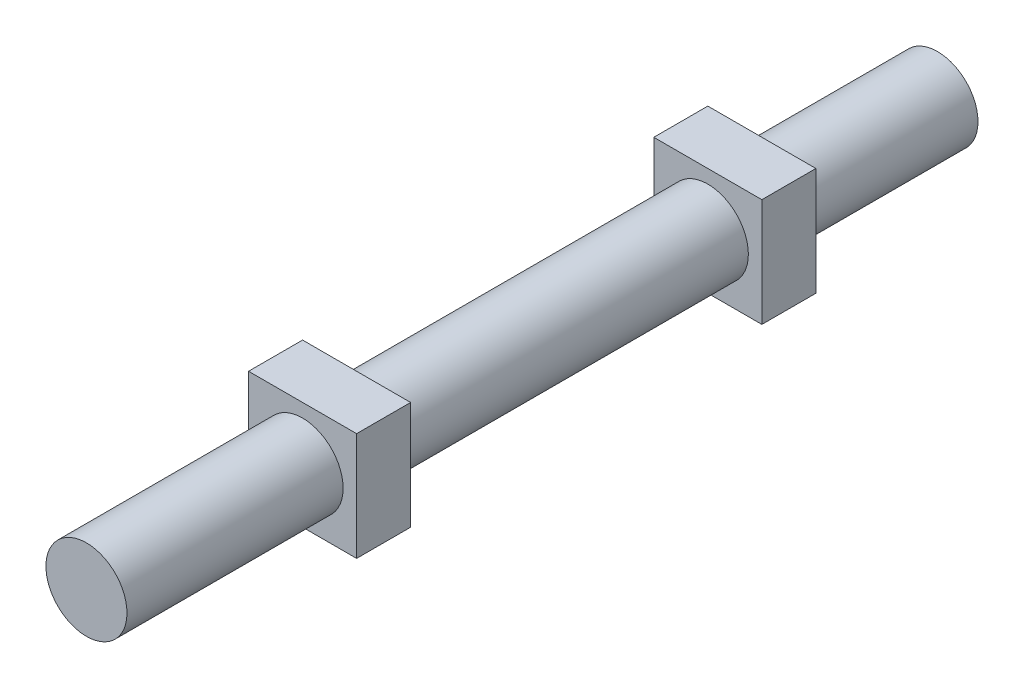
ISO-10303-21;
HEADER;
FILE_DESCRIPTION(('STEP AP214'),'2;1');
FILE_NAME('part.step','',(''),(''),'','','');
FILE_SCHEMA(('AUTOMOTIVE_DESIGN { 1 0 10303 214 1 1 1 1 }'));
ENDSEC;
DATA;
#1=APPLICATION_CONTEXT('core data for automotive mechanical design processes');
#2=APPLICATION_PROTOCOL_DEFINITION('international standard','automotive_design',2000,#1);
#3=PRODUCT_CONTEXT('',#1,'mechanical');
#4=PRODUCT('Part','Part','',(#3));
#5=PRODUCT_RELATED_PRODUCT_CATEGORY('part','',(#4));
#6=PRODUCT_DEFINITION_FORMATION('','',#4);
#7=PRODUCT_DEFINITION_CONTEXT('part definition',#1,'design');
#8=PRODUCT_DEFINITION('design','',#6,#7);
#9=PRODUCT_DEFINITION_SHAPE('','',#8);
#10=(LENGTH_UNIT() NAMED_UNIT(*) SI_UNIT(.MILLI.,.METRE.));
#11=(NAMED_UNIT(*) PLANE_ANGLE_UNIT() SI_UNIT($,.RADIAN.));
#12=(NAMED_UNIT(*) SI_UNIT($,.STERADIAN.) SOLID_ANGLE_UNIT());
#13=UNCERTAINTY_MEASURE_WITH_UNIT(LENGTH_MEASURE(1.E-05),#10,'distance_accuracy_value','');
#14=(GEOMETRIC_REPRESENTATION_CONTEXT(3) GLOBAL_UNCERTAINTY_ASSIGNED_CONTEXT((#13)) GLOBAL_UNIT_ASSIGNED_CONTEXT((#10,
#11,#12)) REPRESENTATION_CONTEXT('',''));
#15=CARTESIAN_POINT('',(0.,0.,0.));
#16=DIRECTION('',(0.,0.,1.));
#17=DIRECTION('',(1.,0.,0.));
#18=AXIS2_PLACEMENT_3D('',#15,#16,#17);
#19=CARTESIAN_POINT('',(0.,0.,157.5));
#20=DIRECTION('',(0.,0.,-1.));
#21=DIRECTION('',(-1.,0.,0.));
#22=AXIS2_PLACEMENT_3D('',#19,#20,#21);
#23=CYLINDRICAL_SURFACE('',#22,7.5);
#24=CARTESIAN_POINT('',(0.,0.,117.5));
#25=DIRECTION('',(0.,0.,1.));
#26=DIRECTION('',(1.,0.,0.));
#27=AXIS2_PLACEMENT_3D('',#24,#25,#26);
#28=CIRCLE('',#27,7.5);
#29=CARTESIAN_POINT('',(7.5,0.,117.5));
#30=VERTEX_POINT('',#29);
#31=EDGE_CURVE('E173',#30,#30,#28,.T.);
#32=ORIENTED_EDGE('',*,*,#31,.T.);
#33=EDGE_LOOP('',(#32));
#34=FACE_BOUND('',#33,.T.);
#35=CARTESIAN_POINT('',(0.,0.,157.5));
#36=DIRECTION('',(0.,0.,1.));
#37=DIRECTION('',(1.,0.,0.));
#38=AXIS2_PLACEMENT_3D('',#35,#36,#37);
#39=CIRCLE('',#38,7.5);
#40=CARTESIAN_POINT('',(7.5,0.,157.5));
#41=VERTEX_POINT('',#40);
#42=EDGE_CURVE('E174',#41,#41,#39,.T.);
#43=ORIENTED_EDGE('',*,*,#42,.F.);
#44=EDGE_LOOP('',(#43));
#45=FACE_BOUND('',#44,.T.);
#46=ADVANCED_FACE('F45',(#34,#45),#23,.T.);
#47=CARTESIAN_POINT('',(0.,0.,157.5));
#48=DIRECTION('',(0.,0.,1.));
#49=DIRECTION('',(1.,0.,0.));
#50=AXIS2_PLACEMENT_3D('',#47,#48,#49);
#51=PLANE('',#50);
#52=ORIENTED_EDGE('',*,*,#42,.T.);
#53=EDGE_LOOP('',(#52));
#54=FACE_BOUND('',#53,.T.);
#55=ADVANCED_FACE('F213',(#54),#51,.T.);
#56=CARTESIAN_POINT('',(10.,10.,117.5));
#57=DIRECTION('',(-1.,0.,0.));
#58=DIRECTION('',(0.,0.,1.));
#59=AXIS2_PLACEMENT_3D('',#56,#57,#58);
#60=PLANE('',#59);
#61=DIRECTION('',(0.,1.,0.));
#62=VECTOR('',#61,1.);
#63=CARTESIAN_POINT('',(10.,10.,107.5));
#64=LINE('',#63,#62);
#65=CARTESIAN_POINT('',(10.,-10.,107.5));
#66=VERTEX_POINT('',#65);
#67=CARTESIAN_POINT('',(10.,10.,107.5));
#68=VERTEX_POINT('',#67);
#69=EDGE_CURVE('E148',#66,#68,#64,.T.);
#70=ORIENTED_EDGE('',*,*,#69,.T.);
#71=DIRECTION('',(0.,0.,-1.));
#72=VECTOR('',#71,1.);
#73=CARTESIAN_POINT('',(10.,10.,117.5));
#74=LINE('',#73,#72);
#75=CARTESIAN_POINT('',(10.,10.,117.5));
#76=VERTEX_POINT('',#75);
#77=EDGE_CURVE('E171',#76,#68,#74,.T.);
#78=ORIENTED_EDGE('',*,*,#77,.F.);
#79=DIRECTION('',(0.,1.,0.));
#80=VECTOR('',#79,1.);
#81=CARTESIAN_POINT('',(10.,10.,117.5));
#82=LINE('',#81,#80);
#83=CARTESIAN_POINT('',(10.,-10.,117.5));
#84=VERTEX_POINT('',#83);
#85=EDGE_CURVE('E153',#84,#76,#82,.T.);
#86=ORIENTED_EDGE('',*,*,#85,.F.);
#87=DIRECTION('',(0.,0.,-1.));
#88=VECTOR('',#87,1.);
#89=CARTESIAN_POINT('',(10.,-10.,117.5));
#90=LINE('',#89,#88);
#91=EDGE_CURVE('E159',#84,#66,#90,.T.);
#92=ORIENTED_EDGE('',*,*,#91,.T.);
#93=EDGE_LOOP('',(#70,#78,#86,#92));
#94=FACE_BOUND('',#93,.T.);
#95=ADVANCED_FACE('F195',(#94),#60,.F.);
#96=CARTESIAN_POINT('',(-10.,10.,117.5));
#97=DIRECTION('',(0.,-1.,0.));
#98=DIRECTION('',(0.,0.,-1.));
#99=AXIS2_PLACEMENT_3D('',#96,#97,#98);
#100=PLANE('',#99);
#101=DIRECTION('',(-1.,0.,0.));
#102=VECTOR('',#101,1.);
#103=CARTESIAN_POINT('',(-10.,10.,107.5));
#104=LINE('',#103,#102);
#105=CARTESIAN_POINT('',(-10.,10.,107.5));
#106=VERTEX_POINT('',#105);
#107=EDGE_CURVE('E162',#68,#106,#104,.T.);
#108=ORIENTED_EDGE('',*,*,#107,.T.);
#109=DIRECTION('',(0.,0.,-1.));
#110=VECTOR('',#109,1.);
#111=CARTESIAN_POINT('',(-10.,10.,117.5));
#112=LINE('',#111,#110);
#113=CARTESIAN_POINT('',(-10.,10.,117.5));
#114=VERTEX_POINT('',#113);
#115=EDGE_CURVE('E169',#114,#106,#112,.T.);
#116=ORIENTED_EDGE('',*,*,#115,.F.);
#117=DIRECTION('',(-1.,0.,0.));
#118=VECTOR('',#117,1.);
#119=CARTESIAN_POINT('',(-10.,10.,117.5));
#120=LINE('',#119,#118);
#121=EDGE_CURVE('E94',#76,#114,#120,.T.);
#122=ORIENTED_EDGE('',*,*,#121,.F.);
#123=ORIENTED_EDGE('',*,*,#77,.T.);
#124=EDGE_LOOP('',(#108,#116,#122,#123));
#125=FACE_BOUND('',#124,.T.);
#126=ADVANCED_FACE('F197',(#125),#100,.F.);
#127=CARTESIAN_POINT('',(-10.,10.,117.5));
#128=DIRECTION('',(1.,0.,0.));
#129=DIRECTION('',(0.,1.,0.));
#130=AXIS2_PLACEMENT_3D('',#127,#128,#129);
#131=PLANE('',#130);
#132=DIRECTION('',(0.,-1.,0.));
#133=VECTOR('',#132,1.);
#134=CARTESIAN_POINT('',(-10.,10.,107.5));
#135=LINE('',#134,#133);
#136=CARTESIAN_POINT('',(-10.,-10.,107.5));
#137=VERTEX_POINT('',#136);
#138=EDGE_CURVE('E80',#106,#137,#135,.T.);
#139=ORIENTED_EDGE('',*,*,#138,.T.);
#140=DIRECTION('',(0.,0.,-1.));
#141=VECTOR('',#140,1.);
#142=CARTESIAN_POINT('',(-10.,-10.,117.5));
#143=LINE('',#142,#141);
#144=CARTESIAN_POINT('',(-10.,-10.,117.5));
#145=VERTEX_POINT('',#144);
#146=EDGE_CURVE('E167',#145,#137,#143,.T.);
#147=ORIENTED_EDGE('',*,*,#146,.F.);
#148=DIRECTION('',(0.,-1.,0.));
#149=VECTOR('',#148,1.);
#150=CARTESIAN_POINT('',(-10.,10.,117.5));
#151=LINE('',#150,#149);
#152=EDGE_CURVE('E156',#114,#145,#151,.T.);
#153=ORIENTED_EDGE('',*,*,#152,.F.);
#154=ORIENTED_EDGE('',*,*,#115,.T.);
#155=EDGE_LOOP('',(#139,#147,#153,#154));
#156=FACE_BOUND('',#155,.T.);
#157=ADVANCED_FACE('F200',(#156),#131,.F.);
#158=CARTESIAN_POINT('',(-10.,-10.,117.5));
#159=DIRECTION('',(0.,1.,0.));
#160=DIRECTION('',(0.,0.,1.));
#161=AXIS2_PLACEMENT_3D('',#158,#159,#160);
#162=PLANE('',#161);
#163=DIRECTION('',(1.,0.,0.));
#164=VECTOR('',#163,1.);
#165=CARTESIAN_POINT('',(-10.,-10.,107.5));
#166=LINE('',#165,#164);
#167=EDGE_CURVE('E86',#137,#66,#166,.T.);
#168=ORIENTED_EDGE('',*,*,#167,.T.);
#169=ORIENTED_EDGE('',*,*,#91,.F.);
#170=DIRECTION('',(1.,0.,0.));
#171=VECTOR('',#170,1.);
#172=CARTESIAN_POINT('',(-10.,-10.,117.5));
#173=LINE('',#172,#171);
#174=EDGE_CURVE('E62',#145,#84,#173,.T.);
#175=ORIENTED_EDGE('',*,*,#174,.F.);
#176=ORIENTED_EDGE('',*,*,#146,.T.);
#177=EDGE_LOOP('',(#168,#169,#175,#176));
#178=FACE_BOUND('',#177,.T.);
#179=ADVANCED_FACE('F190',(#178),#162,.F.);
#180=CARTESIAN_POINT('',(0.,0.,117.5));
#181=DIRECTION('',(0.,0.,1.));
#182=DIRECTION('',(1.,0.,0.));
#183=AXIS2_PLACEMENT_3D('',#180,#181,#182);
#184=PLANE('',#183);
#185=ORIENTED_EDGE('',*,*,#31,.F.);
#186=EDGE_LOOP('',(#185));
#187=FACE_BOUND('',#186,.T.);
#188=ORIENTED_EDGE('',*,*,#85,.T.);
#189=ORIENTED_EDGE('',*,*,#121,.T.);
#190=ORIENTED_EDGE('',*,*,#152,.T.);
#191=ORIENTED_EDGE('',*,*,#174,.T.);
#192=EDGE_LOOP('',(#188,#189,#190,#191));
#193=FACE_BOUND('',#192,.T.);
#194=ADVANCED_FACE('F187',(#187,#193),#184,.T.);
#195=CARTESIAN_POINT('',(0.,0.,107.5));
#196=DIRECTION('',(0.,0.,1.));
#197=DIRECTION('',(1.,0.,0.));
#198=AXIS2_PLACEMENT_3D('',#195,#196,#197);
#199=PLANE('',#198);
#200=CARTESIAN_POINT('',(0.,0.,107.5));
#201=DIRECTION('',(0.,0.,1.));
#202=DIRECTION('',(1.,0.,0.));
#203=AXIS2_PLACEMENT_3D('',#200,#201,#202);
#204=CIRCLE('',#203,7.5);
#205=CARTESIAN_POINT('',(7.5,0.,107.5));
#206=VERTEX_POINT('',#205);
#207=EDGE_CURVE('E54',#206,#206,#204,.T.);
#208=ORIENTED_EDGE('',*,*,#207,.T.);
#209=EDGE_LOOP('',(#208));
#210=FACE_BOUND('',#209,.T.);
#211=ORIENTED_EDGE('',*,*,#69,.F.);
#212=ORIENTED_EDGE('',*,*,#167,.F.);
#213=ORIENTED_EDGE('',*,*,#138,.F.);
#214=ORIENTED_EDGE('',*,*,#107,.F.);
#215=EDGE_LOOP('',(#211,#212,#213,#214));
#216=FACE_BOUND('',#215,.T.);
#217=ADVANCED_FACE('F189',(#210,#216),#199,.F.);
#218=CARTESIAN_POINT('',(0.,0.,42.5));
#219=DIRECTION('',(0.,0.,1.));
#220=DIRECTION('',(1.,0.,0.));
#221=AXIS2_PLACEMENT_3D('',#218,#219,#220);
#222=CIRCLE('',#221,7.5);
#223=CARTESIAN_POINT('',(7.5,0.,42.5));
#224=VERTEX_POINT('',#223);
#225=EDGE_CURVE('E48',#224,#224,#222,.T.);
#226=ORIENTED_EDGE('',*,*,#225,.T.);
#227=EDGE_LOOP('',(#226));
#228=FACE_BOUND('',#227,.T.);
#229=ORIENTED_EDGE('',*,*,#207,.F.);
#230=EDGE_LOOP('',(#229));
#231=FACE_BOUND('',#230,.T.);
#232=ADVANCED_FACE('F202',(#228,#231),#23,.T.);
#233=CARTESIAN_POINT('',(10.,10.,42.5));
#234=DIRECTION('',(-1.,0.,0.));
#235=DIRECTION('',(0.,0.,1.));
#236=AXIS2_PLACEMENT_3D('',#233,#234,#235);
#237=PLANE('',#236);
#238=DIRECTION('',(0.,1.,0.));
#239=VECTOR('',#238,1.);
#240=CARTESIAN_POINT('',(10.,10.,32.5));
#241=LINE('',#240,#239);
#242=CARTESIAN_POINT('',(10.,-10.,32.5));
#243=VERTEX_POINT('',#242);
#244=CARTESIAN_POINT('',(10.,10.,32.5));
#245=VERTEX_POINT('',#244);
#246=EDGE_CURVE('E145',#243,#245,#241,.T.);
#247=ORIENTED_EDGE('',*,*,#246,.T.);
#248=DIRECTION('',(0.,0.,-1.));
#249=VECTOR('',#248,1.);
#250=CARTESIAN_POINT('',(10.,10.,42.5));
#251=LINE('',#250,#249);
#252=CARTESIAN_POINT('',(10.,10.,42.5));
#253=VERTEX_POINT('',#252);
#254=EDGE_CURVE('E125',#253,#245,#251,.T.);
#255=ORIENTED_EDGE('',*,*,#254,.F.);
#256=DIRECTION('',(0.,1.,0.));
#257=VECTOR('',#256,1.);
#258=CARTESIAN_POINT('',(10.,10.,42.5));
#259=LINE('',#258,#257);
#260=CARTESIAN_POINT('',(10.,-10.,42.5));
#261=VERTEX_POINT('',#260);
#262=EDGE_CURVE('E132',#261,#253,#259,.T.);
#263=ORIENTED_EDGE('',*,*,#262,.F.);
#264=DIRECTION('',(0.,0.,-1.));
#265=VECTOR('',#264,1.);
#266=CARTESIAN_POINT('',(10.,-10.,42.5));
#267=LINE('',#266,#265);
#268=EDGE_CURVE('E247',#261,#243,#267,.T.);
#269=ORIENTED_EDGE('',*,*,#268,.T.);
#270=EDGE_LOOP('',(#247,#255,#263,#269));
#271=FACE_BOUND('',#270,.T.);
#272=ADVANCED_FACE('F143',(#271),#237,.F.);
#273=CARTESIAN_POINT('',(-10.,10.,42.5));
#274=DIRECTION('',(0.,-1.,0.));
#275=DIRECTION('',(0.,0.,-1.));
#276=AXIS2_PLACEMENT_3D('',#273,#274,#275);
#277=PLANE('',#276);
#278=DIRECTION('',(-1.,0.,0.));
#279=VECTOR('',#278,1.);
#280=CARTESIAN_POINT('',(-10.,10.,32.5));
#281=LINE('',#280,#279);
#282=CARTESIAN_POINT('',(-10.,10.,32.5));
#283=VERTEX_POINT('',#282);
#284=EDGE_CURVE('E238',#245,#283,#281,.T.);
#285=ORIENTED_EDGE('',*,*,#284,.T.);
#286=DIRECTION('',(0.,0.,-1.));
#287=VECTOR('',#286,1.);
#288=CARTESIAN_POINT('',(-10.,10.,42.5));
#289=LINE('',#288,#287);
#290=CARTESIAN_POINT('',(-10.,10.,42.5));
#291=VERTEX_POINT('',#290);
#292=EDGE_CURVE('E128',#291,#283,#289,.T.);
#293=ORIENTED_EDGE('',*,*,#292,.F.);
#294=DIRECTION('',(-1.,0.,0.));
#295=VECTOR('',#294,1.);
#296=CARTESIAN_POINT('',(-10.,10.,42.5));
#297=LINE('',#296,#295);
#298=EDGE_CURVE('E121',#253,#291,#297,.T.);
#299=ORIENTED_EDGE('',*,*,#298,.F.);
#300=ORIENTED_EDGE('',*,*,#254,.T.);
#301=EDGE_LOOP('',(#285,#293,#299,#300));
#302=FACE_BOUND('',#301,.T.);
#303=ADVANCED_FACE('F123',(#302),#277,.F.);
#304=CARTESIAN_POINT('',(-10.,10.,42.5));
#305=DIRECTION('',(1.,0.,0.));
#306=DIRECTION('',(0.,0.,-1.));
#307=AXIS2_PLACEMENT_3D('',#304,#305,#306);
#308=PLANE('',#307);
#309=DIRECTION('',(0.,-1.,0.));
#310=VECTOR('',#309,1.);
#311=CARTESIAN_POINT('',(-10.,10.,32.5));
#312=LINE('',#311,#310);
#313=CARTESIAN_POINT('',(-10.,-10.,32.5));
#314=VERTEX_POINT('',#313);
#315=EDGE_CURVE('E240',#283,#314,#312,.T.);
#316=ORIENTED_EDGE('',*,*,#315,.T.);
#317=DIRECTION('',(0.,0.,-1.));
#318=VECTOR('',#317,1.);
#319=CARTESIAN_POINT('',(-10.,-10.,42.5));
#320=LINE('',#319,#318);
#321=CARTESIAN_POINT('',(-10.,-10.,42.5));
#322=VERTEX_POINT('',#321);
#323=EDGE_CURVE('E149',#322,#314,#320,.T.);
#324=ORIENTED_EDGE('',*,*,#323,.F.);
#325=DIRECTION('',(0.,-1.,0.));
#326=VECTOR('',#325,1.);
#327=CARTESIAN_POINT('',(-10.,10.,42.5));
#328=LINE('',#327,#326);
#329=EDGE_CURVE('E131',#291,#322,#328,.T.);
#330=ORIENTED_EDGE('',*,*,#329,.F.);
#331=ORIENTED_EDGE('',*,*,#292,.T.);
#332=EDGE_LOOP('',(#316,#324,#330,#331));
#333=FACE_BOUND('',#332,.T.);
#334=ADVANCED_FACE('F253',(#333),#308,.F.);
#335=CARTESIAN_POINT('',(-10.,-10.,42.5));
#336=DIRECTION('',(0.,1.,0.));
#337=DIRECTION('',(0.,0.,1.));
#338=AXIS2_PLACEMENT_3D('',#335,#336,#337);
#339=PLANE('',#338);
#340=DIRECTION('',(1.,0.,0.));
#341=VECTOR('',#340,1.);
#342=CARTESIAN_POINT('',(-10.,-10.,32.5));
#343=LINE('',#342,#341);
#344=EDGE_CURVE('E141',#314,#243,#343,.T.);
#345=ORIENTED_EDGE('',*,*,#344,.T.);
#346=ORIENTED_EDGE('',*,*,#268,.F.);
#347=DIRECTION('',(1.,0.,0.));
#348=VECTOR('',#347,1.);
#349=CARTESIAN_POINT('',(-10.,-10.,42.5));
#350=LINE('',#349,#348);
#351=EDGE_CURVE('E137',#322,#261,#350,.T.);
#352=ORIENTED_EDGE('',*,*,#351,.F.);
#353=ORIENTED_EDGE('',*,*,#323,.T.);
#354=EDGE_LOOP('',(#345,#346,#352,#353));
#355=FACE_BOUND('',#354,.T.);
#356=ADVANCED_FACE('F251',(#355),#339,.F.);
#357=CARTESIAN_POINT('',(0.,0.,42.5));
#358=DIRECTION('',(0.,0.,1.));
#359=DIRECTION('',(1.,0.,0.));
#360=AXIS2_PLACEMENT_3D('',#357,#358,#359);
#361=PLANE('',#360);
#362=ORIENTED_EDGE('',*,*,#225,.F.);
#363=EDGE_LOOP('',(#362));
#364=FACE_BOUND('',#363,.T.);
#365=ORIENTED_EDGE('',*,*,#262,.T.);
#366=ORIENTED_EDGE('',*,*,#298,.T.);
#367=ORIENTED_EDGE('',*,*,#329,.T.);
#368=ORIENTED_EDGE('',*,*,#351,.T.);
#369=EDGE_LOOP('',(#365,#366,#367,#368));
#370=FACE_BOUND('',#369,.T.);
#371=ADVANCED_FACE('F135',(#364,#370),#361,.T.);
#372=CARTESIAN_POINT('',(0.,0.,32.5));
#373=DIRECTION('',(0.,0.,1.));
#374=DIRECTION('',(1.,0.,0.));
#375=AXIS2_PLACEMENT_3D('',#372,#373,#374);
#376=PLANE('',#375);
#377=CARTESIAN_POINT('',(0.,0.,32.5));
#378=DIRECTION('',(0.,0.,1.));
#379=DIRECTION('',(1.,0.,0.));
#380=AXIS2_PLACEMENT_3D('',#377,#378,#379);
#381=CIRCLE('',#380,7.5);
#382=CARTESIAN_POINT('',(7.5,0.,32.5));
#383=VERTEX_POINT('',#382);
#384=EDGE_CURVE('E11',#383,#383,#381,.T.);
#385=ORIENTED_EDGE('',*,*,#384,.T.);
#386=EDGE_LOOP('',(#385));
#387=FACE_BOUND('',#386,.T.);
#388=ORIENTED_EDGE('',*,*,#246,.F.);
#389=ORIENTED_EDGE('',*,*,#344,.F.);
#390=ORIENTED_EDGE('',*,*,#315,.F.);
#391=ORIENTED_EDGE('',*,*,#284,.F.);
#392=EDGE_LOOP('',(#388,#389,#390,#391));
#393=FACE_BOUND('',#392,.T.);
#394=ADVANCED_FACE('F227',(#387,#393),#376,.F.);
#395=CARTESIAN_POINT('',(0.,0.,0.));
#396=DIRECTION('',(0.,0.,1.));
#397=DIRECTION('',(1.,0.,0.));
#398=AXIS2_PLACEMENT_3D('',#395,#396,#397);
#399=PLANE('',#398);
#400=CARTESIAN_POINT('',(0.,0.,0.));
#401=DIRECTION('',(0.,0.,1.));
#402=DIRECTION('',(1.,0.,0.));
#403=AXIS2_PLACEMENT_3D('',#400,#401,#402);
#404=CIRCLE('',#403,7.5);
#405=CARTESIAN_POINT('',(7.5,0.,0.));
#406=VERTEX_POINT('',#405);
#407=EDGE_CURVE('E177',#406,#406,#404,.T.);
#408=ORIENTED_EDGE('',*,*,#407,.F.);
#409=EDGE_LOOP('',(#408));
#410=FACE_BOUND('',#409,.T.);
#411=ADVANCED_FACE('F222',(#410),#399,.F.);
#412=ORIENTED_EDGE('',*,*,#407,.T.);
#413=EDGE_LOOP('',(#412));
#414=FACE_BOUND('',#413,.T.);
#415=ORIENTED_EDGE('',*,*,#384,.F.);
#416=EDGE_LOOP('',(#415));
#417=FACE_BOUND('',#416,.T.);
#418=ADVANCED_FACE('F210',(#414,#417),#23,.T.);
#419=CLOSED_SHELL('',(#46,#55,#95,#126,#157,#179,#194,#217,#232,#272,#303,#334,#356,#371,#394,
#411,#418));
#420=MANIFOLD_SOLID_BREP('B2',#419);
#421=ADVANCED_BREP_SHAPE_REPRESENTATION('',(#18,#420),#14);
#422=SHAPE_DEFINITION_REPRESENTATION(#9,#421);
ENDSEC;
END-ISO-10303-21;
